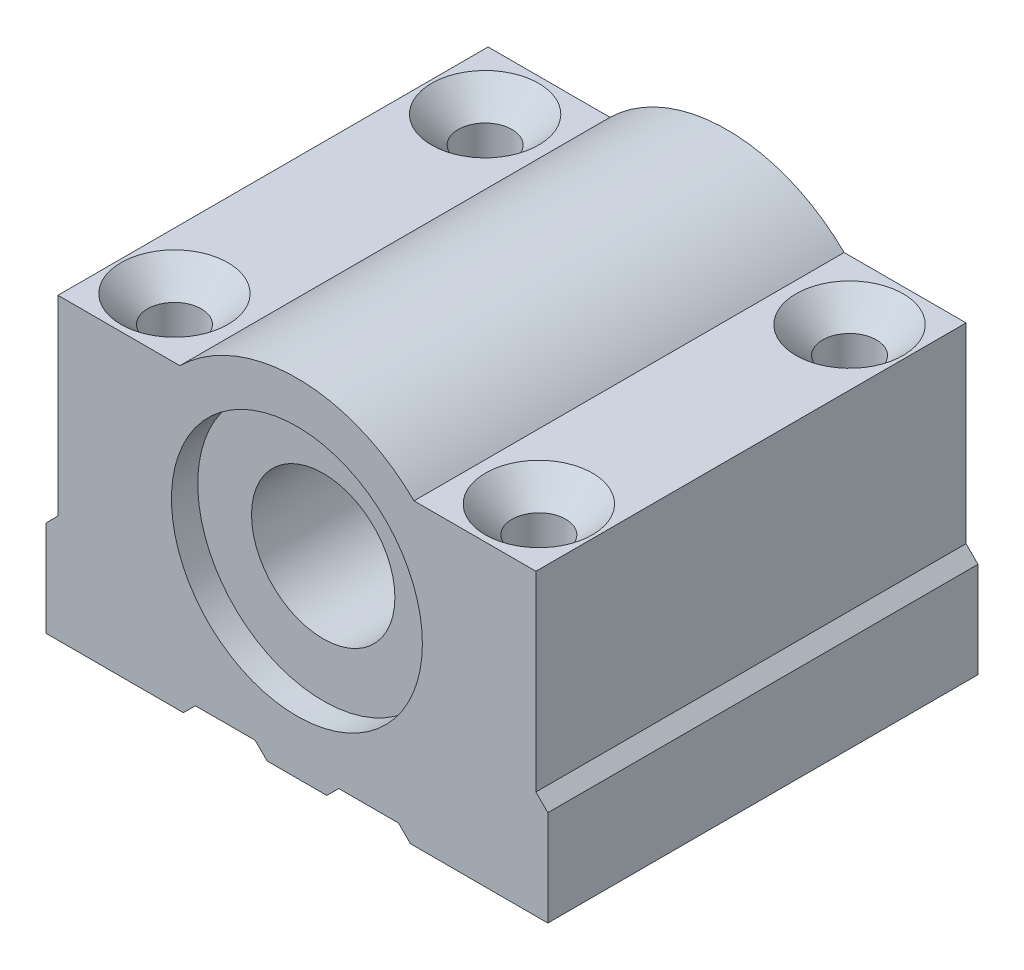
ISO-10303-21;
HEADER;
FILE_DESCRIPTION(('STEP AP214'),'2;1');
FILE_NAME('part.step','',(''),(''),'','','');
FILE_SCHEMA(('AUTOMOTIVE_DESIGN { 1 0 10303 214 1 1 1 1 }'));
ENDSEC;
DATA;
#1=APPLICATION_CONTEXT('core data for automotive mechanical design processes');
#2=APPLICATION_PROTOCOL_DEFINITION('international standard','automotive_design',2000,#1);
#3=PRODUCT_CONTEXT('',#1,'mechanical');
#4=PRODUCT('Part','Part','',(#3));
#5=PRODUCT_RELATED_PRODUCT_CATEGORY('part','',(#4));
#6=PRODUCT_DEFINITION_FORMATION('','',#4);
#7=PRODUCT_DEFINITION_CONTEXT('part definition',#1,'design');
#8=PRODUCT_DEFINITION('design','',#6,#7);
#9=PRODUCT_DEFINITION_SHAPE('','',#8);
#10=(LENGTH_UNIT() NAMED_UNIT(*) SI_UNIT(.MILLI.,.METRE.));
#11=(NAMED_UNIT(*) PLANE_ANGLE_UNIT() SI_UNIT($,.RADIAN.));
#12=(NAMED_UNIT(*) SI_UNIT($,.STERADIAN.) SOLID_ANGLE_UNIT());
#13=UNCERTAINTY_MEASURE_WITH_UNIT(LENGTH_MEASURE(1.E-05),#10,'distance_accuracy_value','');
#14=(GEOMETRIC_REPRESENTATION_CONTEXT(3) GLOBAL_UNCERTAINTY_ASSIGNED_CONTEXT((#13)) GLOBAL_UNIT_ASSIGNED_CONTEXT((#10,
#11,#12)) REPRESENTATION_CONTEXT('',''));
#15=CARTESIAN_POINT('',(0.,0.,0.));
#16=DIRECTION('',(0.,0.,1.));
#17=DIRECTION('',(1.,0.,0.));
#18=AXIS2_PLACEMENT_3D('',#15,#16,#17);
#19=CARTESIAN_POINT('',(0.,0.,36.));
#20=DIRECTION('',(0.,0.,-1.));
#21=DIRECTION('',(-1.,0.,0.));
#22=AXIS2_PLACEMENT_3D('',#19,#20,#21);
#23=CYLINDRICAL_SURFACE('',#22,6.);
#24=CARTESIAN_POINT('',(0.,0.,33.8));
#25=DIRECTION('',(0.,0.,1.));
#26=DIRECTION('',(1.,0.,0.));
#27=AXIS2_PLACEMENT_3D('',#24,#25,#26);
#28=CIRCLE('',#27,6.);
#29=CARTESIAN_POINT('',(6.,0.,33.8));
#30=VERTEX_POINT('',#29);
#31=EDGE_CURVE('E195',#30,#30,#28,.T.);
#32=ORIENTED_EDGE('',*,*,#31,.T.);
#33=EDGE_LOOP('',(#32));
#34=FACE_BOUND('',#33,.T.);
#35=CARTESIAN_POINT('',(0.,0.,2.2));
#36=DIRECTION('',(0.,0.,-1.));
#37=DIRECTION('',(-1.,0.,0.));
#38=AXIS2_PLACEMENT_3D('',#35,#36,#37);
#39=CIRCLE('',#38,6.);
#40=CARTESIAN_POINT('',(-6.,0.,2.2));
#41=VERTEX_POINT('',#40);
#42=EDGE_CURVE('E271',#41,#41,#39,.T.);
#43=ORIENTED_EDGE('',*,*,#42,.T.);
#44=EDGE_LOOP('',(#43));
#45=FACE_BOUND('',#44,.T.);
#46=ADVANCED_FACE('F32',(#34,#45),#23,.F.);
#47=CARTESIAN_POINT('',(0.,0.,36.));
#48=DIRECTION('',(0.,0.,-1.));
#49=DIRECTION('',(-1.,0.,0.));
#50=AXIS2_PLACEMENT_3D('',#47,#48,#49);
#51=PLANE('',#50);
#52=CARTESIAN_POINT('',(0.,0.,36.));
#53=DIRECTION('',(0.,0.,1.));
#54=DIRECTION('',(1.,0.,0.));
#55=AXIS2_PLACEMENT_3D('',#52,#53,#54);
#56=CIRCLE('',#55,10.5);
#57=CARTESIAN_POINT('',(10.5,0.,36.));
#58=VERTEX_POINT('',#57);
#59=EDGE_CURVE('E274',#58,#58,#56,.T.);
#60=ORIENTED_EDGE('',*,*,#59,.F.);
#61=EDGE_LOOP('',(#60));
#62=FACE_BOUND('',#61,.T.);
#63=DIRECTION('',(-1.,0.,0.));
#64=VECTOR('',#63,1.);
#65=CARTESIAN_POINT('',(-9.79795897113271,10.,36.));
#66=LINE('',#65,#64);
#67=CARTESIAN_POINT('',(-9.79795897113271,10.,36.));
#68=VERTEX_POINT('',#67);
#69=CARTESIAN_POINT('',(-20.,10.,36.));
#70=VERTEX_POINT('',#69);
#71=EDGE_CURVE('E226',#68,#70,#66,.T.);
#72=ORIENTED_EDGE('',*,*,#71,.T.);
#73=DIRECTION('',(0.,-1.,0.));
#74=VECTOR('',#73,1.);
#75=CARTESIAN_POINT('',(-20.,10.,36.));
#76=LINE('',#75,#74);
#77=CARTESIAN_POINT('',(-20.,-6.,36.));
#78=VERTEX_POINT('',#77);
#79=EDGE_CURVE('E124',#70,#78,#76,.T.);
#80=ORIENTED_EDGE('',*,*,#79,.T.);
#81=DIRECTION('',(-0.707106781186545,-0.70710678118655,0.));
#82=VECTOR('',#81,1.);
#83=CARTESIAN_POINT('',(-20.,-6.,36.));
#84=LINE('',#83,#82);
#85=CARTESIAN_POINT('',(-21.,-7.,36.));
#86=VERTEX_POINT('',#85);
#87=EDGE_CURVE('E354',#78,#86,#84,.T.);
#88=ORIENTED_EDGE('',*,*,#87,.T.);
#89=DIRECTION('',(0.,-1.,0.));
#90=VECTOR('',#89,1.);
#91=CARTESIAN_POINT('',(-21.,-7.,36.));
#92=LINE('',#91,#90);
#93=CARTESIAN_POINT('',(-21.,-15.,36.));
#94=VERTEX_POINT('',#93);
#95=EDGE_CURVE('E356',#86,#94,#92,.T.);
#96=ORIENTED_EDGE('',*,*,#95,.T.);
#97=DIRECTION('',(1.,0.,0.));
#98=VECTOR('',#97,1.);
#99=CARTESIAN_POINT('',(-21.,-15.,36.));
#100=LINE('',#99,#98);
#101=CARTESIAN_POINT('',(-9.5,-15.,36.));
#102=VERTEX_POINT('',#101);
#103=EDGE_CURVE('E358',#94,#102,#100,.T.);
#104=ORIENTED_EDGE('',*,*,#103,.T.);
#105=DIRECTION('',(0.707106781186547,0.707106781186547,0.));
#106=VECTOR('',#105,1.);
#107=CARTESIAN_POINT('',(-9.5,-15.,36.));
#108=LINE('',#107,#106);
#109=CARTESIAN_POINT('',(-8.5,-14.,36.));
#110=VERTEX_POINT('',#109);
#111=EDGE_CURVE('E360',#102,#110,#108,.T.);
#112=ORIENTED_EDGE('',*,*,#111,.T.);
#113=DIRECTION('',(1.,0.,0.));
#114=VECTOR('',#113,1.);
#115=CARTESIAN_POINT('',(-8.5,-14.,36.));
#116=LINE('',#115,#114);
#117=CARTESIAN_POINT('',(-3.5,-14.,36.));
#118=VERTEX_POINT('',#117);
#119=EDGE_CURVE('E362',#110,#118,#116,.T.);
#120=ORIENTED_EDGE('',*,*,#119,.T.);
#121=DIRECTION('',(0.707106781186547,-0.707106781186547,0.));
#122=VECTOR('',#121,1.);
#123=CARTESIAN_POINT('',(-3.5,-14.,36.));
#124=LINE('',#123,#122);
#125=CARTESIAN_POINT('',(-2.5,-15.,36.));
#126=VERTEX_POINT('',#125);
#127=EDGE_CURVE('E364',#118,#126,#124,.T.);
#128=ORIENTED_EDGE('',*,*,#127,.T.);
#129=DIRECTION('',(1.,0.,0.));
#130=VECTOR('',#129,1.);
#131=CARTESIAN_POINT('',(-2.5,-15.,36.));
#132=LINE('',#131,#130);
#133=CARTESIAN_POINT('',(2.5,-15.,36.));
#134=VERTEX_POINT('',#133);
#135=EDGE_CURVE('E366',#126,#134,#132,.T.);
#136=ORIENTED_EDGE('',*,*,#135,.T.);
#137=DIRECTION('',(0.707106781186548,0.707106781186547,0.));
#138=VECTOR('',#137,1.);
#139=CARTESIAN_POINT('',(2.5,-15.,36.));
#140=LINE('',#139,#138);
#141=CARTESIAN_POINT('',(3.5,-14.,36.));
#142=VERTEX_POINT('',#141);
#143=EDGE_CURVE('E368',#134,#142,#140,.T.);
#144=ORIENTED_EDGE('',*,*,#143,.T.);
#145=DIRECTION('',(1.,0.,0.));
#146=VECTOR('',#145,1.);
#147=CARTESIAN_POINT('',(3.5,-14.,36.));
#148=LINE('',#147,#146);
#149=CARTESIAN_POINT('',(8.5,-14.,36.));
#150=VERTEX_POINT('',#149);
#151=EDGE_CURVE('E370',#142,#150,#148,.T.);
#152=ORIENTED_EDGE('',*,*,#151,.T.);
#153=DIRECTION('',(0.707106781186547,-0.707106781186547,0.));
#154=VECTOR('',#153,1.);
#155=CARTESIAN_POINT('',(8.5,-14.,36.));
#156=LINE('',#155,#154);
#157=CARTESIAN_POINT('',(9.5,-15.,36.));
#158=VERTEX_POINT('',#157);
#159=EDGE_CURVE('E372',#150,#158,#156,.T.);
#160=ORIENTED_EDGE('',*,*,#159,.T.);
#161=DIRECTION('',(1.,0.,0.));
#162=VECTOR('',#161,1.);
#163=CARTESIAN_POINT('',(9.5,-15.,36.));
#164=LINE('',#163,#162);
#165=CARTESIAN_POINT('',(21.,-15.,36.));
#166=VERTEX_POINT('',#165);
#167=EDGE_CURVE('E374',#158,#166,#164,.T.);
#168=ORIENTED_EDGE('',*,*,#167,.T.);
#169=DIRECTION('',(0.,1.,0.));
#170=VECTOR('',#169,1.);
#171=CARTESIAN_POINT('',(21.,-15.,36.));
#172=LINE('',#171,#170);
#173=CARTESIAN_POINT('',(21.,-7.,36.));
#174=VERTEX_POINT('',#173);
#175=EDGE_CURVE('E376',#166,#174,#172,.T.);
#176=ORIENTED_EDGE('',*,*,#175,.T.);
#177=DIRECTION('',(-0.707106781186548,0.707106781186548,0.));
#178=VECTOR('',#177,1.);
#179=CARTESIAN_POINT('',(21.,-7.,36.));
#180=LINE('',#179,#178);
#181=CARTESIAN_POINT('',(20.,-5.99999999999999,36.));
#182=VERTEX_POINT('',#181);
#183=EDGE_CURVE('E173',#174,#182,#180,.T.);
#184=ORIENTED_EDGE('',*,*,#183,.T.);
#185=DIRECTION('',(0.,1.,0.));
#186=VECTOR('',#185,1.);
#187=CARTESIAN_POINT('',(20.,-5.99999999999999,36.));
#188=LINE('',#187,#186);
#189=CARTESIAN_POINT('',(20.,10.,36.));
#190=VERTEX_POINT('',#189);
#191=EDGE_CURVE('E167',#182,#190,#188,.T.);
#192=ORIENTED_EDGE('',*,*,#191,.T.);
#193=DIRECTION('',(-1.,0.,0.));
#194=VECTOR('',#193,1.);
#195=CARTESIAN_POINT('',(20.,10.,36.));
#196=LINE('',#195,#194);
#197=CARTESIAN_POINT('',(9.79795897113272,10.,36.));
#198=VERTEX_POINT('',#197);
#199=EDGE_CURVE('E171',#190,#198,#196,.T.);
#200=ORIENTED_EDGE('',*,*,#199,.T.);
#201=CARTESIAN_POINT('',(0.,0.,36.));
#202=DIRECTION('',(0.,0.,1.));
#203=DIRECTION('',(-1.,0.,0.));
#204=AXIS2_PLACEMENT_3D('',#201,#202,#203);
#205=CIRCLE('',#204,14.);
#206=EDGE_CURVE('E51',#198,#68,#205,.T.);
#207=ORIENTED_EDGE('',*,*,#206,.T.);
#208=EDGE_LOOP('',(#72,#80,#88,#96,#104,#112,#120,#128,#136,#144,#152,#160,#168,#176,#184,#192,
#200,#207));
#209=FACE_BOUND('',#208,.T.);
#210=ADVANCED_FACE('F169',(#62,#209),#51,.F.);
#211=CARTESIAN_POINT('',(0.,0.,0.));
#212=DIRECTION('',(0.,0.,-1.));
#213=DIRECTION('',(-1.,0.,0.));
#214=AXIS2_PLACEMENT_3D('',#211,#212,#213);
#215=PLANE('',#214);
#216=CARTESIAN_POINT('',(0.,0.,0.));
#217=DIRECTION('',(0.,0.,-1.));
#218=DIRECTION('',(-1.,0.,0.));
#219=AXIS2_PLACEMENT_3D('',#216,#217,#218);
#220=CIRCLE('',#219,10.5);
#221=CARTESIAN_POINT('',(-10.5,0.,0.));
#222=VERTEX_POINT('',#221);
#223=EDGE_CURVE('E343',#222,#222,#220,.T.);
#224=ORIENTED_EDGE('',*,*,#223,.F.);
#225=EDGE_LOOP('',(#224));
#226=FACE_BOUND('',#225,.T.);
#227=DIRECTION('',(-1.,0.,0.));
#228=VECTOR('',#227,1.);
#229=CARTESIAN_POINT('',(-9.79795897113271,10.,0.));
#230=LINE('',#229,#228);
#231=CARTESIAN_POINT('',(-9.79795897113271,10.,0.));
#232=VERTEX_POINT('',#231);
#233=CARTESIAN_POINT('',(-20.,10.,0.));
#234=VERTEX_POINT('',#233);
#235=EDGE_CURVE('E191',#232,#234,#230,.T.);
#236=ORIENTED_EDGE('',*,*,#235,.F.);
#237=CARTESIAN_POINT('',(0.,0.,0.));
#238=DIRECTION('',(0.,0.,1.));
#239=DIRECTION('',(-1.,0.,0.));
#240=AXIS2_PLACEMENT_3D('',#237,#238,#239);
#241=CIRCLE('',#240,14.);
#242=CARTESIAN_POINT('',(9.79795897113272,10.,0.));
#243=VERTEX_POINT('',#242);
#244=EDGE_CURVE('E116',#243,#232,#241,.T.);
#245=ORIENTED_EDGE('',*,*,#244,.F.);
#246=DIRECTION('',(-1.,0.,0.));
#247=VECTOR('',#246,1.);
#248=CARTESIAN_POINT('',(20.,10.,0.));
#249=LINE('',#248,#247);
#250=CARTESIAN_POINT('',(20.,10.,0.));
#251=VERTEX_POINT('',#250);
#252=EDGE_CURVE('E110',#251,#243,#249,.T.);
#253=ORIENTED_EDGE('',*,*,#252,.F.);
#254=DIRECTION('',(0.,1.,0.));
#255=VECTOR('',#254,1.);
#256=CARTESIAN_POINT('',(20.,-5.99999999999999,0.));
#257=LINE('',#256,#255);
#258=CARTESIAN_POINT('',(20.,-5.99999999999999,0.));
#259=VERTEX_POINT('',#258);
#260=EDGE_CURVE('E181',#259,#251,#257,.T.);
#261=ORIENTED_EDGE('',*,*,#260,.F.);
#262=DIRECTION('',(-0.707106781186548,0.707106781186548,0.));
#263=VECTOR('',#262,1.);
#264=CARTESIAN_POINT('',(21.,-7.,0.));
#265=LINE('',#264,#263);
#266=CARTESIAN_POINT('',(21.,-7.,0.));
#267=VERTEX_POINT('',#266);
#268=EDGE_CURVE('E221',#267,#259,#265,.T.);
#269=ORIENTED_EDGE('',*,*,#268,.F.);
#270=DIRECTION('',(0.,1.,0.));
#271=VECTOR('',#270,1.);
#272=CARTESIAN_POINT('',(21.,-15.,0.));
#273=LINE('',#272,#271);
#274=CARTESIAN_POINT('',(21.,-15.,0.));
#275=VERTEX_POINT('',#274);
#276=EDGE_CURVE('E219',#275,#267,#273,.T.);
#277=ORIENTED_EDGE('',*,*,#276,.F.);
#278=DIRECTION('',(1.,0.,0.));
#279=VECTOR('',#278,1.);
#280=CARTESIAN_POINT('',(9.5,-15.,0.));
#281=LINE('',#280,#279);
#282=CARTESIAN_POINT('',(9.5,-15.,0.));
#283=VERTEX_POINT('',#282);
#284=EDGE_CURVE('E217',#283,#275,#281,.T.);
#285=ORIENTED_EDGE('',*,*,#284,.F.);
#286=DIRECTION('',(0.707106781186547,-0.707106781186547,0.));
#287=VECTOR('',#286,1.);
#288=CARTESIAN_POINT('',(8.5,-14.,0.));
#289=LINE('',#288,#287);
#290=CARTESIAN_POINT('',(8.5,-14.,0.));
#291=VERTEX_POINT('',#290);
#292=EDGE_CURVE('E215',#291,#283,#289,.T.);
#293=ORIENTED_EDGE('',*,*,#292,.F.);
#294=DIRECTION('',(1.,0.,0.));
#295=VECTOR('',#294,1.);
#296=CARTESIAN_POINT('',(3.5,-14.,0.));
#297=LINE('',#296,#295);
#298=CARTESIAN_POINT('',(3.5,-14.,0.));
#299=VERTEX_POINT('',#298);
#300=EDGE_CURVE('E213',#299,#291,#297,.T.);
#301=ORIENTED_EDGE('',*,*,#300,.F.);
#302=DIRECTION('',(0.707106781186548,0.707106781186547,0.));
#303=VECTOR('',#302,1.);
#304=CARTESIAN_POINT('',(2.5,-15.,0.));
#305=LINE('',#304,#303);
#306=CARTESIAN_POINT('',(2.5,-15.,0.));
#307=VERTEX_POINT('',#306);
#308=EDGE_CURVE('E211',#307,#299,#305,.T.);
#309=ORIENTED_EDGE('',*,*,#308,.F.);
#310=DIRECTION('',(1.,0.,0.));
#311=VECTOR('',#310,1.);
#312=CARTESIAN_POINT('',(-2.5,-15.,0.));
#313=LINE('',#312,#311);
#314=CARTESIAN_POINT('',(-2.5,-15.,0.));
#315=VERTEX_POINT('',#314);
#316=EDGE_CURVE('E209',#315,#307,#313,.T.);
#317=ORIENTED_EDGE('',*,*,#316,.F.);
#318=DIRECTION('',(0.707106781186547,-0.707106781186547,0.));
#319=VECTOR('',#318,1.);
#320=CARTESIAN_POINT('',(-3.5,-14.,0.));
#321=LINE('',#320,#319);
#322=CARTESIAN_POINT('',(-3.5,-14.,0.));
#323=VERTEX_POINT('',#322);
#324=EDGE_CURVE('E207',#323,#315,#321,.T.);
#325=ORIENTED_EDGE('',*,*,#324,.F.);
#326=DIRECTION('',(1.,0.,0.));
#327=VECTOR('',#326,1.);
#328=CARTESIAN_POINT('',(-8.5,-14.,0.));
#329=LINE('',#328,#327);
#330=CARTESIAN_POINT('',(-8.5,-14.,0.));
#331=VERTEX_POINT('',#330);
#332=EDGE_CURVE('E205',#331,#323,#329,.T.);
#333=ORIENTED_EDGE('',*,*,#332,.F.);
#334=DIRECTION('',(0.707106781186547,0.707106781186547,0.));
#335=VECTOR('',#334,1.);
#336=CARTESIAN_POINT('',(-9.5,-15.,0.));
#337=LINE('',#336,#335);
#338=CARTESIAN_POINT('',(-9.5,-15.,0.));
#339=VERTEX_POINT('',#338);
#340=EDGE_CURVE('E203',#339,#331,#337,.T.);
#341=ORIENTED_EDGE('',*,*,#340,.F.);
#342=DIRECTION('',(1.,0.,0.));
#343=VECTOR('',#342,1.);
#344=CARTESIAN_POINT('',(-21.,-15.,0.));
#345=LINE('',#344,#343);
#346=CARTESIAN_POINT('',(-21.,-15.,0.));
#347=VERTEX_POINT('',#346);
#348=EDGE_CURVE('E201',#347,#339,#345,.T.);
#349=ORIENTED_EDGE('',*,*,#348,.F.);
#350=DIRECTION('',(0.,-1.,0.));
#351=VECTOR('',#350,1.);
#352=CARTESIAN_POINT('',(-21.,-7.,0.));
#353=LINE('',#352,#351);
#354=CARTESIAN_POINT('',(-21.,-7.,0.));
#355=VERTEX_POINT('',#354);
#356=EDGE_CURVE('E199',#355,#347,#353,.T.);
#357=ORIENTED_EDGE('',*,*,#356,.F.);
#358=DIRECTION('',(-0.707106781186545,-0.70710678118655,0.));
#359=VECTOR('',#358,1.);
#360=CARTESIAN_POINT('',(-20.,-6.,0.));
#361=LINE('',#360,#359);
#362=CARTESIAN_POINT('',(-20.,-6.,0.));
#363=VERTEX_POINT('',#362);
#364=EDGE_CURVE('E197',#363,#355,#361,.T.);
#365=ORIENTED_EDGE('',*,*,#364,.F.);
#366=DIRECTION('',(0.,-1.,0.));
#367=VECTOR('',#366,1.);
#368=CARTESIAN_POINT('',(-20.,10.,0.));
#369=LINE('',#368,#367);
#370=EDGE_CURVE('E194',#234,#363,#369,.T.);
#371=ORIENTED_EDGE('',*,*,#370,.F.);
#372=EDGE_LOOP('',(#236,#245,#253,#261,#269,#277,#285,#293,#301,#309,#317,#325,#333,#341,#349,
#357,#365,#371));
#373=FACE_BOUND('',#372,.T.);
#374=ADVANCED_FACE('F389',(#226,#373),#215,.T.);
#375=CARTESIAN_POINT('',(-9.79795897113271,10.,36.));
#376=DIRECTION('',(0.,-1.,0.));
#377=DIRECTION('',(0.,0.,-1.));
#378=AXIS2_PLACEMENT_3D('',#375,#376,#377);
#379=PLANE('',#378);
#380=CARTESIAN_POINT('',(-15.25,10.,5.));
#381=DIRECTION('',(0.,1.,0.));
#382=DIRECTION('',(0.,0.,1.));
#383=AXIS2_PLACEMENT_3D('',#380,#381,#382);
#384=CIRCLE('',#383,4.48);
#385=CARTESIAN_POINT('',(-15.25,10.,9.48));
#386=VERTEX_POINT('',#385);
#387=EDGE_CURVE('E526',#386,#386,#384,.T.);
#388=ORIENTED_EDGE('',*,*,#387,.F.);
#389=EDGE_LOOP('',(#388));
#390=FACE_BOUND('',#389,.T.);
#391=CARTESIAN_POINT('',(-15.25,10.,31.));
#392=DIRECTION('',(0.,1.,0.));
#393=DIRECTION('',(0.,0.,1.));
#394=AXIS2_PLACEMENT_3D('',#391,#392,#393);
#395=CIRCLE('',#394,4.48);
#396=CARTESIAN_POINT('',(-15.25,10.,35.48));
#397=VERTEX_POINT('',#396);
#398=EDGE_CURVE('E294',#397,#397,#395,.T.);
#399=ORIENTED_EDGE('',*,*,#398,.F.);
#400=EDGE_LOOP('',(#399));
#401=FACE_BOUND('',#400,.T.);
#402=ORIENTED_EDGE('',*,*,#235,.T.);
#403=DIRECTION('',(0.,0.,-1.));
#404=VECTOR('',#403,1.);
#405=CARTESIAN_POINT('',(-20.,10.,36.));
#406=LINE('',#405,#404);
#407=EDGE_CURVE('E11',#70,#234,#406,.T.);
#408=ORIENTED_EDGE('',*,*,#407,.F.);
#409=ORIENTED_EDGE('',*,*,#71,.F.);
#410=DIRECTION('',(0.,0.,-1.));
#411=VECTOR('',#410,1.);
#412=CARTESIAN_POINT('',(-9.79795897113271,10.,36.));
#413=LINE('',#412,#411);
#414=EDGE_CURVE('E187',#68,#232,#413,.T.);
#415=ORIENTED_EDGE('',*,*,#414,.T.);
#416=EDGE_LOOP('',(#402,#408,#409,#415));
#417=FACE_BOUND('',#416,.T.);
#418=ADVANCED_FACE('F34',(#390,#401,#417),#379,.F.);
#419=CARTESIAN_POINT('',(-20.,10.,36.));
#420=DIRECTION('',(1.,0.,0.));
#421=DIRECTION('',(0.,1.,0.));
#422=AXIS2_PLACEMENT_3D('',#419,#420,#421);
#423=PLANE('',#422);
#424=ORIENTED_EDGE('',*,*,#370,.T.);
#425=DIRECTION('',(0.,0.,-1.));
#426=VECTOR('',#425,1.);
#427=CARTESIAN_POINT('',(-20.,-6.,36.));
#428=LINE('',#427,#426);
#429=EDGE_CURVE('E42',#78,#363,#428,.T.);
#430=ORIENTED_EDGE('',*,*,#429,.F.);
#431=ORIENTED_EDGE('',*,*,#79,.F.);
#432=ORIENTED_EDGE('',*,*,#407,.T.);
#433=EDGE_LOOP('',(#424,#430,#431,#432));
#434=FACE_BOUND('',#433,.T.);
#435=ADVANCED_FACE('F423',(#434),#423,.F.);
#436=CARTESIAN_POINT('',(-20.,-6.,36.));
#437=DIRECTION('',(0.70710678118655,-0.707106781186545,0.));
#438=DIRECTION('',(0.707106781186545,0.70710678118655,0.));
#439=AXIS2_PLACEMENT_3D('',#436,#437,#438);
#440=PLANE('',#439);
#441=ORIENTED_EDGE('',*,*,#364,.T.);
#442=DIRECTION('',(0.,0.,-1.));
#443=VECTOR('',#442,1.);
#444=CARTESIAN_POINT('',(-21.,-7.,36.));
#445=LINE('',#444,#443);
#446=EDGE_CURVE('E263',#86,#355,#445,.T.);
#447=ORIENTED_EDGE('',*,*,#446,.F.);
#448=ORIENTED_EDGE('',*,*,#87,.F.);
#449=ORIENTED_EDGE('',*,*,#429,.T.);
#450=EDGE_LOOP('',(#441,#447,#448,#449));
#451=FACE_BOUND('',#450,.T.);
#452=ADVANCED_FACE('F572',(#451),#440,.F.);
#453=CARTESIAN_POINT('',(-21.,-7.,36.));
#454=DIRECTION('',(1.,0.,0.));
#455=DIRECTION('',(0.,0.,-1.));
#456=AXIS2_PLACEMENT_3D('',#453,#454,#455);
#457=PLANE('',#456);
#458=ORIENTED_EDGE('',*,*,#356,.T.);
#459=DIRECTION('',(0.,0.,-1.));
#460=VECTOR('',#459,1.);
#461=CARTESIAN_POINT('',(-21.,-15.,36.));
#462=LINE('',#461,#460);
#463=EDGE_CURVE('E260',#94,#347,#462,.T.);
#464=ORIENTED_EDGE('',*,*,#463,.F.);
#465=ORIENTED_EDGE('',*,*,#95,.F.);
#466=ORIENTED_EDGE('',*,*,#446,.T.);
#467=EDGE_LOOP('',(#458,#464,#465,#466));
#468=FACE_BOUND('',#467,.T.);
#469=ADVANCED_FACE('F542',(#468),#457,.F.);
#470=CARTESIAN_POINT('',(-21.,-15.,36.));
#471=DIRECTION('',(0.,1.,0.));
#472=DIRECTION('',(0.,0.,1.));
#473=AXIS2_PLACEMENT_3D('',#470,#471,#472);
#474=PLANE('',#473);
#475=CARTESIAN_POINT('',(-15.25,-15.,31.));
#476=DIRECTION('',(0.,-1.,0.));
#477=DIRECTION('',(0.,0.,-1.));
#478=AXIS2_PLACEMENT_3D('',#475,#476,#477);
#479=CIRCLE('',#478,4.5);
#480=CARTESIAN_POINT('',(-15.25,-15.,26.5));
#481=VERTEX_POINT('',#480);
#482=EDGE_CURVE('E279',#481,#481,#479,.T.);
#483=ORIENTED_EDGE('',*,*,#482,.F.);
#484=EDGE_LOOP('',(#483));
#485=FACE_BOUND('',#484,.T.);
#486=CARTESIAN_POINT('',(-15.25,-15.,5.));
#487=DIRECTION('',(0.,-1.,0.));
#488=DIRECTION('',(0.,0.,-1.));
#489=AXIS2_PLACEMENT_3D('',#486,#487,#488);
#490=CIRCLE('',#489,4.5);
#491=CARTESIAN_POINT('',(-15.25,-15.,0.499999999999997));
#492=VERTEX_POINT('',#491);
#493=EDGE_CURVE('E316',#492,#492,#490,.T.);
#494=ORIENTED_EDGE('',*,*,#493,.F.);
#495=EDGE_LOOP('',(#494));
#496=FACE_BOUND('',#495,.T.);
#497=ORIENTED_EDGE('',*,*,#348,.T.);
#498=DIRECTION('',(0.,0.,-1.));
#499=VECTOR('',#498,1.);
#500=CARTESIAN_POINT('',(-9.5,-15.,36.));
#501=LINE('',#500,#499);
#502=EDGE_CURVE('E257',#102,#339,#501,.T.);
#503=ORIENTED_EDGE('',*,*,#502,.F.);
#504=ORIENTED_EDGE('',*,*,#103,.F.);
#505=ORIENTED_EDGE('',*,*,#463,.T.);
#506=EDGE_LOOP('',(#497,#503,#504,#505));
#507=FACE_BOUND('',#506,.T.);
#508=ADVANCED_FACE('F538',(#485,#496,#507),#474,.F.);
#509=CARTESIAN_POINT('',(-9.5,-15.,36.));
#510=DIRECTION('',(-0.707106781186547,0.707106781186547,0.));
#511=DIRECTION('',(-0.707106781186548,-0.707106781186548,0.));
#512=AXIS2_PLACEMENT_3D('',#509,#510,#511);
#513=PLANE('',#512);
#514=ORIENTED_EDGE('',*,*,#340,.T.);
#515=DIRECTION('',(0.,0.,-1.));
#516=VECTOR('',#515,1.);
#517=CARTESIAN_POINT('',(-8.5,-14.,36.));
#518=LINE('',#517,#516);
#519=EDGE_CURVE('E254',#110,#331,#518,.T.);
#520=ORIENTED_EDGE('',*,*,#519,.F.);
#521=ORIENTED_EDGE('',*,*,#111,.F.);
#522=ORIENTED_EDGE('',*,*,#502,.T.);
#523=EDGE_LOOP('',(#514,#520,#521,#522));
#524=FACE_BOUND('',#523,.T.);
#525=ADVANCED_FACE('F541',(#524),#513,.F.);
#526=CARTESIAN_POINT('',(-8.5,-14.,36.));
#527=DIRECTION('',(0.,1.,0.));
#528=DIRECTION('',(0.,0.,1.));
#529=AXIS2_PLACEMENT_3D('',#526,#527,#528);
#530=PLANE('',#529);
#531=ORIENTED_EDGE('',*,*,#332,.T.);
#532=DIRECTION('',(0.,0.,-1.));
#533=VECTOR('',#532,1.);
#534=CARTESIAN_POINT('',(-3.5,-14.,36.));
#535=LINE('',#534,#533);
#536=EDGE_CURVE('E251',#118,#323,#535,.T.);
#537=ORIENTED_EDGE('',*,*,#536,.F.);
#538=ORIENTED_EDGE('',*,*,#119,.F.);
#539=ORIENTED_EDGE('',*,*,#519,.T.);
#540=EDGE_LOOP('',(#531,#537,#538,#539));
#541=FACE_BOUND('',#540,.T.);
#542=ADVANCED_FACE('F559',(#541),#530,.F.);
#543=CARTESIAN_POINT('',(-3.5,-14.,36.));
#544=DIRECTION('',(0.707106781186547,0.707106781186547,0.));
#545=DIRECTION('',(-0.707106781186548,0.707106781186548,0.));
#546=AXIS2_PLACEMENT_3D('',#543,#544,#545);
#547=PLANE('',#546);
#548=ORIENTED_EDGE('',*,*,#324,.T.);
#549=DIRECTION('',(0.,0.,-1.));
#550=VECTOR('',#549,1.);
#551=CARTESIAN_POINT('',(-2.5,-15.,36.));
#552=LINE('',#551,#550);
#553=EDGE_CURVE('E248',#126,#315,#552,.T.);
#554=ORIENTED_EDGE('',*,*,#553,.F.);
#555=ORIENTED_EDGE('',*,*,#127,.F.);
#556=ORIENTED_EDGE('',*,*,#536,.T.);
#557=EDGE_LOOP('',(#548,#554,#555,#556));
#558=FACE_BOUND('',#557,.T.);
#559=ADVANCED_FACE('F563',(#558),#547,.F.);
#560=CARTESIAN_POINT('',(-2.5,-15.,36.));
#561=DIRECTION('',(0.,1.,0.));
#562=DIRECTION('',(0.,0.,1.));
#563=AXIS2_PLACEMENT_3D('',#560,#561,#562);
#564=PLANE('',#563);
#565=ORIENTED_EDGE('',*,*,#316,.T.);
#566=DIRECTION('',(0.,0.,-1.));
#567=VECTOR('',#566,1.);
#568=CARTESIAN_POINT('',(2.5,-15.,36.));
#569=LINE('',#568,#567);
#570=EDGE_CURVE('E245',#134,#307,#569,.T.);
#571=ORIENTED_EDGE('',*,*,#570,.F.);
#572=ORIENTED_EDGE('',*,*,#135,.F.);
#573=ORIENTED_EDGE('',*,*,#553,.T.);
#574=EDGE_LOOP('',(#565,#571,#572,#573));
#575=FACE_BOUND('',#574,.T.);
#576=ADVANCED_FACE('F587',(#575),#564,.F.);
#577=CARTESIAN_POINT('',(2.5,-15.,36.));
#578=DIRECTION('',(-0.707106781186547,0.707106781186548,0.));
#579=DIRECTION('',(-0.707106781186548,-0.707106781186547,0.));
#580=AXIS2_PLACEMENT_3D('',#577,#578,#579);
#581=PLANE('',#580);
#582=ORIENTED_EDGE('',*,*,#308,.T.);
#583=DIRECTION('',(0.,0.,-1.));
#584=VECTOR('',#583,1.);
#585=CARTESIAN_POINT('',(3.5,-14.,36.));
#586=LINE('',#585,#584);
#587=EDGE_CURVE('E242',#142,#299,#586,.T.);
#588=ORIENTED_EDGE('',*,*,#587,.F.);
#589=ORIENTED_EDGE('',*,*,#143,.F.);
#590=ORIENTED_EDGE('',*,*,#570,.T.);
#591=EDGE_LOOP('',(#582,#588,#589,#590));
#592=FACE_BOUND('',#591,.T.);
#593=ADVANCED_FACE('F590',(#592),#581,.F.);
#594=CARTESIAN_POINT('',(3.5,-14.,36.));
#595=DIRECTION('',(0.,1.,0.));
#596=DIRECTION('',(0.,0.,1.));
#597=AXIS2_PLACEMENT_3D('',#594,#595,#596);
#598=PLANE('',#597);
#599=ORIENTED_EDGE('',*,*,#300,.T.);
#600=DIRECTION('',(0.,0.,-1.));
#601=VECTOR('',#600,1.);
#602=CARTESIAN_POINT('',(8.5,-14.,36.));
#603=LINE('',#602,#601);
#604=EDGE_CURVE('E239',#150,#291,#603,.T.);
#605=ORIENTED_EDGE('',*,*,#604,.F.);
#606=ORIENTED_EDGE('',*,*,#151,.F.);
#607=ORIENTED_EDGE('',*,*,#587,.T.);
#608=EDGE_LOOP('',(#599,#605,#606,#607));
#609=FACE_BOUND('',#608,.T.);
#610=ADVANCED_FACE('F594',(#609),#598,.F.);
#611=CARTESIAN_POINT('',(8.5,-14.,36.));
#612=DIRECTION('',(0.707106781186547,0.707106781186547,0.));
#613=DIRECTION('',(-0.707106781186548,0.707106781186548,0.));
#614=AXIS2_PLACEMENT_3D('',#611,#612,#613);
#615=PLANE('',#614);
#616=ORIENTED_EDGE('',*,*,#292,.T.);
#617=DIRECTION('',(0.,0.,-1.));
#618=VECTOR('',#617,1.);
#619=CARTESIAN_POINT('',(9.5,-15.,36.));
#620=LINE('',#619,#618);
#621=EDGE_CURVE('E236',#158,#283,#620,.T.);
#622=ORIENTED_EDGE('',*,*,#621,.F.);
#623=ORIENTED_EDGE('',*,*,#159,.F.);
#624=ORIENTED_EDGE('',*,*,#604,.T.);
#625=EDGE_LOOP('',(#616,#622,#623,#624));
#626=FACE_BOUND('',#625,.T.);
#627=ADVANCED_FACE('F598',(#626),#615,.F.);
#628=CARTESIAN_POINT('',(9.5,-15.,36.));
#629=DIRECTION('',(0.,1.,0.));
#630=DIRECTION('',(0.,0.,1.));
#631=AXIS2_PLACEMENT_3D('',#628,#629,#630);
#632=PLANE('',#631);
#633=CARTESIAN_POINT('',(15.25,-15.,5.));
#634=DIRECTION('',(0.,-1.,0.));
#635=DIRECTION('',(0.,0.,-1.));
#636=AXIS2_PLACEMENT_3D('',#633,#634,#635);
#637=CIRCLE('',#636,4.5);
#638=CARTESIAN_POINT('',(15.25,-15.,0.500000000000001));
#639=VERTEX_POINT('',#638);
#640=EDGE_CURVE('E325',#639,#639,#637,.T.);
#641=ORIENTED_EDGE('',*,*,#640,.F.);
#642=EDGE_LOOP('',(#641));
#643=FACE_BOUND('',#642,.T.);
#644=CARTESIAN_POINT('',(15.25,-15.,31.));
#645=DIRECTION('',(0.,-1.,0.));
#646=DIRECTION('',(0.,0.,-1.));
#647=AXIS2_PLACEMENT_3D('',#644,#645,#646);
#648=CIRCLE('',#647,4.5);
#649=CARTESIAN_POINT('',(15.25,-15.,26.5));
#650=VERTEX_POINT('',#649);
#651=EDGE_CURVE('E334',#650,#650,#648,.T.);
#652=ORIENTED_EDGE('',*,*,#651,.F.);
#653=EDGE_LOOP('',(#652));
#654=FACE_BOUND('',#653,.T.);
#655=ORIENTED_EDGE('',*,*,#284,.T.);
#656=DIRECTION('',(0.,0.,-1.));
#657=VECTOR('',#656,1.);
#658=CARTESIAN_POINT('',(21.,-15.,36.));
#659=LINE('',#658,#657);
#660=EDGE_CURVE('E233',#166,#275,#659,.T.);
#661=ORIENTED_EDGE('',*,*,#660,.F.);
#662=ORIENTED_EDGE('',*,*,#167,.F.);
#663=ORIENTED_EDGE('',*,*,#621,.T.);
#664=EDGE_LOOP('',(#655,#661,#662,#663));
#665=FACE_BOUND('',#664,.T.);
#666=ADVANCED_FACE('F602',(#643,#654,#665),#632,.F.);
#667=CARTESIAN_POINT('',(21.,-15.,36.));
#668=DIRECTION('',(-1.,0.,0.));
#669=DIRECTION('',(0.,0.,1.));
#670=AXIS2_PLACEMENT_3D('',#667,#668,#669);
#671=PLANE('',#670);
#672=ORIENTED_EDGE('',*,*,#276,.T.);
#673=DIRECTION('',(0.,0.,-1.));
#674=VECTOR('',#673,1.);
#675=CARTESIAN_POINT('',(21.,-7.,36.));
#676=LINE('',#675,#674);
#677=EDGE_CURVE('E230',#174,#267,#676,.T.);
#678=ORIENTED_EDGE('',*,*,#677,.F.);
#679=ORIENTED_EDGE('',*,*,#175,.F.);
#680=ORIENTED_EDGE('',*,*,#660,.T.);
#681=EDGE_LOOP('',(#672,#678,#679,#680));
#682=FACE_BOUND('',#681,.T.);
#683=ADVANCED_FACE('F382',(#682),#671,.F.);
#684=CARTESIAN_POINT('',(21.,-7.,36.));
#685=DIRECTION('',(-0.707106781186547,-0.707106781186547,0.));
#686=DIRECTION('',(0.707106781186548,-0.707106781186548,0.));
#687=AXIS2_PLACEMENT_3D('',#684,#685,#686);
#688=PLANE('',#687);
#689=ORIENTED_EDGE('',*,*,#268,.T.);
#690=DIRECTION('',(0.,0.,-1.));
#691=VECTOR('',#690,1.);
#692=CARTESIAN_POINT('',(20.,-5.99999999999999,36.));
#693=LINE('',#692,#691);
#694=EDGE_CURVE('E182',#182,#259,#693,.T.);
#695=ORIENTED_EDGE('',*,*,#694,.F.);
#696=ORIENTED_EDGE('',*,*,#183,.F.);
#697=ORIENTED_EDGE('',*,*,#677,.T.);
#698=EDGE_LOOP('',(#689,#695,#696,#697));
#699=FACE_BOUND('',#698,.T.);
#700=ADVANCED_FACE('F386',(#699),#688,.F.);
#701=CARTESIAN_POINT('',(20.,-5.99999999999999,36.));
#702=DIRECTION('',(-1.,0.,0.));
#703=DIRECTION('',(0.,-1.,0.));
#704=AXIS2_PLACEMENT_3D('',#701,#702,#703);
#705=PLANE('',#704);
#706=ORIENTED_EDGE('',*,*,#260,.T.);
#707=DIRECTION('',(0.,0.,-1.));
#708=VECTOR('',#707,1.);
#709=CARTESIAN_POINT('',(20.,10.,36.));
#710=LINE('',#709,#708);
#711=EDGE_CURVE('E178',#190,#251,#710,.T.);
#712=ORIENTED_EDGE('',*,*,#711,.F.);
#713=ORIENTED_EDGE('',*,*,#191,.F.);
#714=ORIENTED_EDGE('',*,*,#694,.T.);
#715=EDGE_LOOP('',(#706,#712,#713,#714));
#716=FACE_BOUND('',#715,.T.);
#717=ADVANCED_FACE('F179',(#716),#705,.F.);
#718=CARTESIAN_POINT('',(20.,10.,36.));
#719=DIRECTION('',(0.,-1.,0.));
#720=DIRECTION('',(0.,0.,-1.));
#721=AXIS2_PLACEMENT_3D('',#718,#719,#720);
#722=PLANE('',#721);
#723=CARTESIAN_POINT('',(15.25,10.,31.));
#724=DIRECTION('',(0.,1.,0.));
#725=DIRECTION('',(0.,0.,1.));
#726=AXIS2_PLACEMENT_3D('',#723,#724,#725);
#727=CIRCLE('',#726,4.48);
#728=CARTESIAN_POINT('',(15.25,10.,35.48));
#729=VERTEX_POINT('',#728);
#730=EDGE_CURVE('E287',#729,#729,#727,.T.);
#731=ORIENTED_EDGE('',*,*,#730,.F.);
#732=EDGE_LOOP('',(#731));
#733=FACE_BOUND('',#732,.T.);
#734=CARTESIAN_POINT('',(15.25,10.,5.));
#735=DIRECTION('',(0.,1.,0.));
#736=DIRECTION('',(0.,0.,1.));
#737=AXIS2_PLACEMENT_3D('',#734,#735,#736);
#738=CIRCLE('',#737,4.48);
#739=CARTESIAN_POINT('',(15.25,10.,9.48));
#740=VERTEX_POINT('',#739);
#741=EDGE_CURVE('E283',#740,#740,#738,.T.);
#742=ORIENTED_EDGE('',*,*,#741,.F.);
#743=EDGE_LOOP('',(#742));
#744=FACE_BOUND('',#743,.T.);
#745=ORIENTED_EDGE('',*,*,#252,.T.);
#746=DIRECTION('',(0.,0.,-1.));
#747=VECTOR('',#746,1.);
#748=CARTESIAN_POINT('',(9.79795897113272,10.,36.));
#749=LINE('',#748,#747);
#750=EDGE_CURVE('E183',#198,#243,#749,.T.);
#751=ORIENTED_EDGE('',*,*,#750,.F.);
#752=ORIENTED_EDGE('',*,*,#199,.F.);
#753=ORIENTED_EDGE('',*,*,#711,.T.);
#754=EDGE_LOOP('',(#745,#751,#752,#753));
#755=FACE_BOUND('',#754,.T.);
#756=ADVANCED_FACE('F185',(#733,#744,#755),#722,.F.);
#757=CARTESIAN_POINT('',(0.,0.,36.));
#758=DIRECTION('',(0.,0.,-1.));
#759=DIRECTION('',(-1.,0.,0.));
#760=AXIS2_PLACEMENT_3D('',#757,#758,#759);
#761=CYLINDRICAL_SURFACE('',#760,14.);
#762=ORIENTED_EDGE('',*,*,#244,.T.);
#763=ORIENTED_EDGE('',*,*,#414,.F.);
#764=ORIENTED_EDGE('',*,*,#206,.F.);
#765=ORIENTED_EDGE('',*,*,#750,.T.);
#766=EDGE_LOOP('',(#762,#763,#764,#765));
#767=FACE_BOUND('',#766,.T.);
#768=ADVANCED_FACE('F394',(#767),#761,.T.);
#769=CARTESIAN_POINT('',(0.,0.,33.8));
#770=DIRECTION('',(0.,0.,1.));
#771=DIRECTION('',(1.,0.,0.));
#772=AXIS2_PLACEMENT_3D('',#769,#770,#771);
#773=CYLINDRICAL_SURFACE('',#772,10.5);
#774=CARTESIAN_POINT('',(0.,0.,33.8));
#775=DIRECTION('',(0.,0.,1.));
#776=DIRECTION('',(1.,0.,0.));
#777=AXIS2_PLACEMENT_3D('',#774,#775,#776);
#778=CIRCLE('',#777,10.5);
#779=CARTESIAN_POINT('',(10.5,0.,33.8));
#780=VERTEX_POINT('',#779);
#781=EDGE_CURVE('E270',#780,#780,#778,.T.);
#782=ORIENTED_EDGE('',*,*,#781,.F.);
#783=EDGE_LOOP('',(#782));
#784=FACE_BOUND('',#783,.T.);
#785=ORIENTED_EDGE('',*,*,#59,.T.);
#786=EDGE_LOOP('',(#785));
#787=FACE_BOUND('',#786,.T.);
#788=ADVANCED_FACE('F396',(#784,#787),#773,.F.);
#789=CARTESIAN_POINT('',(0.,0.,33.8));
#790=DIRECTION('',(0.,0.,1.));
#791=DIRECTION('',(1.,0.,0.));
#792=AXIS2_PLACEMENT_3D('',#789,#790,#791);
#793=PLANE('',#792);
#794=ORIENTED_EDGE('',*,*,#31,.F.);
#795=EDGE_LOOP('',(#794));
#796=FACE_BOUND('',#795,.T.);
#797=ORIENTED_EDGE('',*,*,#781,.T.);
#798=EDGE_LOOP('',(#797));
#799=FACE_BOUND('',#798,.T.);
#800=ADVANCED_FACE('F402',(#796,#799),#793,.T.);
#801=CARTESIAN_POINT('',(0.,0.,2.2));
#802=DIRECTION('',(0.,0.,-1.));
#803=DIRECTION('',(-1.,0.,0.));
#804=AXIS2_PLACEMENT_3D('',#801,#802,#803);
#805=CYLINDRICAL_SURFACE('',#804,10.5);
#806=CARTESIAN_POINT('',(0.,0.,2.2));
#807=DIRECTION('',(0.,0.,-1.));
#808=DIRECTION('',(-1.,0.,0.));
#809=AXIS2_PLACEMENT_3D('',#806,#807,#808);
#810=CIRCLE('',#809,10.5);
#811=CARTESIAN_POINT('',(-10.5,0.,2.2));
#812=VERTEX_POINT('',#811);
#813=EDGE_CURVE('E275',#812,#812,#810,.T.);
#814=ORIENTED_EDGE('',*,*,#813,.F.);
#815=EDGE_LOOP('',(#814));
#816=FACE_BOUND('',#815,.T.);
#817=ORIENTED_EDGE('',*,*,#223,.T.);
#818=EDGE_LOOP('',(#817));
#819=FACE_BOUND('',#818,.T.);
#820=ADVANCED_FACE('F427',(#816,#819),#805,.F.);
#821=CARTESIAN_POINT('',(0.,0.,2.2));
#822=DIRECTION('',(0.,0.,-1.));
#823=DIRECTION('',(-1.,0.,0.));
#824=AXIS2_PLACEMENT_3D('',#821,#822,#823);
#825=PLANE('',#824);
#826=ORIENTED_EDGE('',*,*,#42,.F.);
#827=EDGE_LOOP('',(#826));
#828=FACE_BOUND('',#827,.T.);
#829=ORIENTED_EDGE('',*,*,#813,.T.);
#830=EDGE_LOOP('',(#829));
#831=FACE_BOUND('',#830,.T.);
#832=ADVANCED_FACE('F429',(#828,#831),#825,.T.);
#833=CARTESIAN_POINT('',(15.25,-3.,31.));
#834=DIRECTION('',(0.,-1.,0.));
#835=DIRECTION('',(0.,0.,-1.));
#836=AXIS2_PLACEMENT_3D('',#833,#834,#835);
#837=CONICAL_SURFACE('',#836,2.75,1.02974425867665);
#838=CARTESIAN_POINT('',(15.25,-2.69956969048622,31.));
#839=DIRECTION('',(0.,-1.,0.));
#840=DIRECTION('',(0.,0.,-1.));
#841=AXIS2_PLACEMENT_3D('',#838,#839,#840);
#842=CIRCLE('',#841,2.25);
#843=CARTESIAN_POINT('',(15.25,-2.69956969048622,28.75));
#844=VERTEX_POINT('',#843);
#845=EDGE_CURVE('E281',#844,#844,#842,.F.);
#846=ORIENTED_EDGE('',*,*,#845,.T.);
#847=EDGE_LOOP('',(#846));
#848=FACE_BOUND('',#847,.T.);
#849=CARTESIAN_POINT('',(15.25,-3.,31.));
#850=DIRECTION('',(0.,-1.,0.));
#851=DIRECTION('',(0.,0.,-1.));
#852=AXIS2_PLACEMENT_3D('',#849,#850,#851);
#853=CIRCLE('',#852,2.75);
#854=CARTESIAN_POINT('',(15.25,-3.,28.25));
#855=VERTEX_POINT('',#854);
#856=EDGE_CURVE('E340',#855,#855,#853,.T.);
#857=ORIENTED_EDGE('',*,*,#856,.T.);
#858=EDGE_LOOP('',(#857));
#859=FACE_BOUND('',#858,.T.);
#860=ADVANCED_FACE('F436',(#848,#859),#837,.F.);
#861=CARTESIAN_POINT('',(15.25,-15.,31.));
#862=DIRECTION('',(0.,-1.,0.));
#863=DIRECTION('',(0.,0.,-1.));
#864=AXIS2_PLACEMENT_3D('',#861,#862,#863);
#865=CYLINDRICAL_SURFACE('',#864,2.75);
#866=ORIENTED_EDGE('',*,*,#856,.F.);
#867=EDGE_LOOP('',(#866));
#868=FACE_BOUND('',#867,.T.);
#869=CARTESIAN_POINT('',(15.25,-13.25,31.));
#870=DIRECTION('',(0.,-1.,0.));
#871=DIRECTION('',(0.,0.,-1.));
#872=AXIS2_PLACEMENT_3D('',#869,#870,#871);
#873=CIRCLE('',#872,2.75);
#874=CARTESIAN_POINT('',(15.25,-13.25,28.25));
#875=VERTEX_POINT('',#874);
#876=EDGE_CURVE('E337',#875,#875,#873,.T.);
#877=ORIENTED_EDGE('',*,*,#876,.T.);
#878=EDGE_LOOP('',(#877));
#879=FACE_BOUND('',#878,.T.);
#880=ADVANCED_FACE('F444',(#868,#879),#865,.F.);
#881=CARTESIAN_POINT('',(15.25,-15.,31.));
#882=DIRECTION('',(0.,-1.,0.));
#883=DIRECTION('',(0.,0.,-1.));
#884=AXIS2_PLACEMENT_3D('',#881,#882,#883);
#885=CONICAL_SURFACE('',#884,4.5,0.785398163397448);
#886=ORIENTED_EDGE('',*,*,#876,.F.);
#887=EDGE_LOOP('',(#886));
#888=FACE_BOUND('',#887,.T.);
#889=ORIENTED_EDGE('',*,*,#651,.T.);
#890=EDGE_LOOP('',(#889));
#891=FACE_BOUND('',#890,.T.);
#892=ADVANCED_FACE('F448',(#888,#891),#885,.F.);
#893=CARTESIAN_POINT('',(15.25,-3.,5.));
#894=DIRECTION('',(0.,-1.,0.));
#895=DIRECTION('',(0.,0.,-1.));
#896=AXIS2_PLACEMENT_3D('',#893,#894,#895);
#897=CONICAL_SURFACE('',#896,2.75,1.02974425867665);
#898=CARTESIAN_POINT('',(15.25,-2.69956969048622,5.));
#899=DIRECTION('',(0.,-1.,0.));
#900=DIRECTION('',(0.,0.,-1.));
#901=AXIS2_PLACEMENT_3D('',#898,#899,#900);
#902=CIRCLE('',#901,2.25);
#903=CARTESIAN_POINT('',(15.25,-2.69956969048622,2.75));
#904=VERTEX_POINT('',#903);
#905=EDGE_CURVE('E276',#904,#904,#902,.F.);
#906=ORIENTED_EDGE('',*,*,#905,.T.);
#907=EDGE_LOOP('',(#906));
#908=FACE_BOUND('',#907,.T.);
#909=CARTESIAN_POINT('',(15.25,-3.,5.));
#910=DIRECTION('',(0.,-1.,0.));
#911=DIRECTION('',(0.,0.,-1.));
#912=AXIS2_PLACEMENT_3D('',#909,#910,#911);
#913=CIRCLE('',#912,2.75);
#914=CARTESIAN_POINT('',(15.25,-3.,2.25));
#915=VERTEX_POINT('',#914);
#916=EDGE_CURVE('E331',#915,#915,#913,.T.);
#917=ORIENTED_EDGE('',*,*,#916,.T.);
#918=EDGE_LOOP('',(#917));
#919=FACE_BOUND('',#918,.T.);
#920=ADVANCED_FACE('F452',(#908,#919),#897,.F.);
#921=CARTESIAN_POINT('',(15.25,-15.,5.));
#922=DIRECTION('',(0.,-1.,0.));
#923=DIRECTION('',(0.,0.,-1.));
#924=AXIS2_PLACEMENT_3D('',#921,#922,#923);
#925=CYLINDRICAL_SURFACE('',#924,2.75);
#926=ORIENTED_EDGE('',*,*,#916,.F.);
#927=EDGE_LOOP('',(#926));
#928=FACE_BOUND('',#927,.T.);
#929=CARTESIAN_POINT('',(15.25,-13.25,5.));
#930=DIRECTION('',(0.,-1.,0.));
#931=DIRECTION('',(0.,0.,-1.));
#932=AXIS2_PLACEMENT_3D('',#929,#930,#931);
#933=CIRCLE('',#932,2.75);
#934=CARTESIAN_POINT('',(15.25,-13.25,2.25));
#935=VERTEX_POINT('',#934);
#936=EDGE_CURVE('E328',#935,#935,#933,.T.);
#937=ORIENTED_EDGE('',*,*,#936,.T.);
#938=EDGE_LOOP('',(#937));
#939=FACE_BOUND('',#938,.T.);
#940=ADVANCED_FACE('F456',(#928,#939),#925,.F.);
#941=CARTESIAN_POINT('',(15.25,-15.,5.));
#942=DIRECTION('',(0.,-1.,0.));
#943=DIRECTION('',(0.,0.,-1.));
#944=AXIS2_PLACEMENT_3D('',#941,#942,#943);
#945=CONICAL_SURFACE('',#944,4.5,0.785398163397448);
#946=ORIENTED_EDGE('',*,*,#936,.F.);
#947=EDGE_LOOP('',(#946));
#948=FACE_BOUND('',#947,.T.);
#949=ORIENTED_EDGE('',*,*,#640,.T.);
#950=EDGE_LOOP('',(#949));
#951=FACE_BOUND('',#950,.T.);
#952=ADVANCED_FACE('F460',(#948,#951),#945,.F.);
#953=CARTESIAN_POINT('',(-15.25,-3.,5.));
#954=DIRECTION('',(0.,-1.,0.));
#955=DIRECTION('',(0.,0.,-1.));
#956=AXIS2_PLACEMENT_3D('',#953,#954,#955);
#957=CONICAL_SURFACE('',#956,2.75,1.02974425867665);
#958=CARTESIAN_POINT('',(-15.25,-2.69956969048622,5.));
#959=DIRECTION('',(0.,-1.,0.));
#960=DIRECTION('',(0.,0.,-1.));
#961=AXIS2_PLACEMENT_3D('',#958,#959,#960);
#962=CIRCLE('',#961,2.25);
#963=CARTESIAN_POINT('',(-15.25,-2.69956969048622,2.75));
#964=VERTEX_POINT('',#963);
#965=EDGE_CURVE('E36',#964,#964,#962,.F.);
#966=ORIENTED_EDGE('',*,*,#965,.T.);
#967=EDGE_LOOP('',(#966));
#968=FACE_BOUND('',#967,.T.);
#969=CARTESIAN_POINT('',(-15.25,-3.,5.));
#970=DIRECTION('',(0.,-1.,0.));
#971=DIRECTION('',(0.,0.,-1.));
#972=AXIS2_PLACEMENT_3D('',#969,#970,#971);
#973=CIRCLE('',#972,2.75);
#974=CARTESIAN_POINT('',(-15.25,-3.,2.25));
#975=VERTEX_POINT('',#974);
#976=EDGE_CURVE('E322',#975,#975,#973,.T.);
#977=ORIENTED_EDGE('',*,*,#976,.T.);
#978=EDGE_LOOP('',(#977));
#979=FACE_BOUND('',#978,.T.);
#980=ADVANCED_FACE('F464',(#968,#979),#957,.F.);
#981=CARTESIAN_POINT('',(-15.25,-15.,5.));
#982=DIRECTION('',(0.,-1.,0.));
#983=DIRECTION('',(0.,0.,-1.));
#984=AXIS2_PLACEMENT_3D('',#981,#982,#983);
#985=CYLINDRICAL_SURFACE('',#984,2.75);
#986=ORIENTED_EDGE('',*,*,#976,.F.);
#987=EDGE_LOOP('',(#986));
#988=FACE_BOUND('',#987,.T.);
#989=CARTESIAN_POINT('',(-15.25,-13.25,5.));
#990=DIRECTION('',(0.,-1.,0.));
#991=DIRECTION('',(0.,0.,-1.));
#992=AXIS2_PLACEMENT_3D('',#989,#990,#991);
#993=CIRCLE('',#992,2.75);
#994=CARTESIAN_POINT('',(-15.25,-13.25,2.25));
#995=VERTEX_POINT('',#994);
#996=EDGE_CURVE('E319',#995,#995,#993,.T.);
#997=ORIENTED_EDGE('',*,*,#996,.T.);
#998=EDGE_LOOP('',(#997));
#999=FACE_BOUND('',#998,.T.);
#1000=ADVANCED_FACE('F468',(#988,#999),#985,.F.);
#1001=CARTESIAN_POINT('',(-15.25,-15.,5.));
#1002=DIRECTION('',(0.,-1.,0.));
#1003=DIRECTION('',(0.,0.,-1.));
#1004=AXIS2_PLACEMENT_3D('',#1001,#1002,#1003);
#1005=CONICAL_SURFACE('',#1004,4.5,0.785398163397448);
#1006=ORIENTED_EDGE('',*,*,#996,.F.);
#1007=EDGE_LOOP('',(#1006));
#1008=FACE_BOUND('',#1007,.T.);
#1009=ORIENTED_EDGE('',*,*,#493,.T.);
#1010=EDGE_LOOP('',(#1009));
#1011=FACE_BOUND('',#1010,.T.);
#1012=ADVANCED_FACE('F472',(#1008,#1011),#1005,.F.);
#1013=CARTESIAN_POINT('',(-15.25,-3.,31.));
#1014=DIRECTION('',(0.,-1.,0.));
#1015=DIRECTION('',(0.,0.,-1.));
#1016=AXIS2_PLACEMENT_3D('',#1013,#1014,#1015);
#1017=CONICAL_SURFACE('',#1016,2.75,1.02974425867665);
#1018=CARTESIAN_POINT('',(-15.25,-2.69956969048622,31.));
#1019=DIRECTION('',(0.,-1.,0.));
#1020=DIRECTION('',(0.,0.,-1.));
#1021=AXIS2_PLACEMENT_3D('',#1018,#1019,#1020);
#1022=CIRCLE('',#1021,2.25);
#1023=CARTESIAN_POINT('',(-15.25,-2.69956969048622,28.75));
#1024=VERTEX_POINT('',#1023);
#1025=EDGE_CURVE('E285',#1024,#1024,#1022,.F.);
#1026=ORIENTED_EDGE('',*,*,#1025,.T.);
#1027=EDGE_LOOP('',(#1026));
#1028=FACE_BOUND('',#1027,.T.);
#1029=CARTESIAN_POINT('',(-15.25,-3.,31.));
#1030=DIRECTION('',(0.,-1.,0.));
#1031=DIRECTION('',(0.,0.,-1.));
#1032=AXIS2_PLACEMENT_3D('',#1029,#1030,#1031);
#1033=CIRCLE('',#1032,2.75);
#1034=CARTESIAN_POINT('',(-15.25,-3.,28.25));
#1035=VERTEX_POINT('',#1034);
#1036=EDGE_CURVE('E313',#1035,#1035,#1033,.T.);
#1037=ORIENTED_EDGE('',*,*,#1036,.T.);
#1038=EDGE_LOOP('',(#1037));
#1039=FACE_BOUND('',#1038,.T.);
#1040=ADVANCED_FACE('F476',(#1028,#1039),#1017,.F.);
#1041=CARTESIAN_POINT('',(-15.25,-15.,31.));
#1042=DIRECTION('',(0.,-1.,0.));
#1043=DIRECTION('',(0.,0.,-1.));
#1044=AXIS2_PLACEMENT_3D('',#1041,#1042,#1043);
#1045=CYLINDRICAL_SURFACE('',#1044,2.75);
#1046=ORIENTED_EDGE('',*,*,#1036,.F.);
#1047=EDGE_LOOP('',(#1046));
#1048=FACE_BOUND('',#1047,.T.);
#1049=CARTESIAN_POINT('',(-15.25,-13.25,31.));
#1050=DIRECTION('',(0.,-1.,0.));
#1051=DIRECTION('',(0.,0.,-1.));
#1052=AXIS2_PLACEMENT_3D('',#1049,#1050,#1051);
#1053=CIRCLE('',#1052,2.75);
#1054=CARTESIAN_POINT('',(-15.25,-13.25,28.25));
#1055=VERTEX_POINT('',#1054);
#1056=EDGE_CURVE('E310',#1055,#1055,#1053,.T.);
#1057=ORIENTED_EDGE('',*,*,#1056,.T.);
#1058=EDGE_LOOP('',(#1057));
#1059=FACE_BOUND('',#1058,.T.);
#1060=ADVANCED_FACE('F480',(#1048,#1059),#1045,.F.);
#1061=CARTESIAN_POINT('',(-15.25,-15.,31.));
#1062=DIRECTION('',(0.,-1.,0.));
#1063=DIRECTION('',(0.,0.,-1.));
#1064=AXIS2_PLACEMENT_3D('',#1061,#1062,#1063);
#1065=CONICAL_SURFACE('',#1064,4.5,0.785398163397448);
#1066=ORIENTED_EDGE('',*,*,#1056,.F.);
#1067=EDGE_LOOP('',(#1066));
#1068=FACE_BOUND('',#1067,.T.);
#1069=ORIENTED_EDGE('',*,*,#482,.T.);
#1070=EDGE_LOOP('',(#1069));
#1071=FACE_BOUND('',#1070,.T.);
#1072=ADVANCED_FACE('F483',(#1068,#1071),#1065,.F.);
#1073=CARTESIAN_POINT('',(15.25,10.,5.));
#1074=DIRECTION('',(0.,1.,0.));
#1075=DIRECTION('',(0.,0.,1.));
#1076=AXIS2_PLACEMENT_3D('',#1073,#1074,#1075);
#1077=CYLINDRICAL_SURFACE('',#1076,2.25);
#1078=CARTESIAN_POINT('',(15.25,7.77,5.));
#1079=DIRECTION('',(0.,1.,0.));
#1080=DIRECTION('',(0.,0.,1.));
#1081=AXIS2_PLACEMENT_3D('',#1078,#1079,#1080);
#1082=CIRCLE('',#1081,2.25);
#1083=CARTESIAN_POINT('',(15.25,7.77,7.25));
#1084=VERTEX_POINT('',#1083);
#1085=EDGE_CURVE('E280',#1084,#1084,#1082,.T.);
#1086=ORIENTED_EDGE('',*,*,#1085,.T.);
#1087=EDGE_LOOP('',(#1086));
#1088=FACE_BOUND('',#1087,.T.);
#1089=ORIENTED_EDGE('',*,*,#905,.F.);
#1090=EDGE_LOOP('',(#1089));
#1091=FACE_BOUND('',#1090,.T.);
#1092=ADVANCED_FACE('F487',(#1088,#1091),#1077,.F.);
#1093=CARTESIAN_POINT('',(15.25,10.,5.));
#1094=DIRECTION('',(0.,1.,0.));
#1095=DIRECTION('',(0.,0.,1.));
#1096=AXIS2_PLACEMENT_3D('',#1093,#1094,#1095);
#1097=CONICAL_SURFACE('',#1096,4.48,0.785398163397449);
#1098=ORIENTED_EDGE('',*,*,#1085,.F.);
#1099=EDGE_LOOP('',(#1098));
#1100=FACE_BOUND('',#1099,.T.);
#1101=ORIENTED_EDGE('',*,*,#741,.T.);
#1102=EDGE_LOOP('',(#1101));
#1103=FACE_BOUND('',#1102,.T.);
#1104=ADVANCED_FACE('F491',(#1100,#1103),#1097,.F.);
#1105=CARTESIAN_POINT('',(15.25,10.,31.));
#1106=DIRECTION('',(0.,1.,0.));
#1107=DIRECTION('',(0.,0.,1.));
#1108=AXIS2_PLACEMENT_3D('',#1105,#1106,#1107);
#1109=CYLINDRICAL_SURFACE('',#1108,2.25);
#1110=CARTESIAN_POINT('',(15.25,7.77,31.));
#1111=DIRECTION('',(0.,1.,0.));
#1112=DIRECTION('',(0.,0.,1.));
#1113=AXIS2_PLACEMENT_3D('',#1110,#1111,#1112);
#1114=CIRCLE('',#1113,2.25);
#1115=CARTESIAN_POINT('',(15.25,7.77,33.25));
#1116=VERTEX_POINT('',#1115);
#1117=EDGE_CURVE('E284',#1116,#1116,#1114,.T.);
#1118=ORIENTED_EDGE('',*,*,#1117,.T.);
#1119=EDGE_LOOP('',(#1118));
#1120=FACE_BOUND('',#1119,.T.);
#1121=ORIENTED_EDGE('',*,*,#845,.F.);
#1122=EDGE_LOOP('',(#1121));
#1123=FACE_BOUND('',#1122,.T.);
#1124=ADVANCED_FACE('F495',(#1120,#1123),#1109,.F.);
#1125=CARTESIAN_POINT('',(15.25,10.,31.));
#1126=DIRECTION('',(0.,1.,0.));
#1127=DIRECTION('',(0.,0.,1.));
#1128=AXIS2_PLACEMENT_3D('',#1125,#1126,#1127);
#1129=CONICAL_SURFACE('',#1128,4.48,0.785398163397449);
#1130=ORIENTED_EDGE('',*,*,#1117,.F.);
#1131=EDGE_LOOP('',(#1130));
#1132=FACE_BOUND('',#1131,.T.);
#1133=ORIENTED_EDGE('',*,*,#730,.T.);
#1134=EDGE_LOOP('',(#1133));
#1135=FACE_BOUND('',#1134,.T.);
#1136=ADVANCED_FACE('F499',(#1132,#1135),#1129,.F.);
#1137=CARTESIAN_POINT('',(-15.25,10.,31.));
#1138=DIRECTION('',(0.,1.,0.));
#1139=DIRECTION('',(0.,0.,1.));
#1140=AXIS2_PLACEMENT_3D('',#1137,#1138,#1139);
#1141=CYLINDRICAL_SURFACE('',#1140,2.25);
#1142=CARTESIAN_POINT('',(-15.25,7.77,31.));
#1143=DIRECTION('',(0.,1.,0.));
#1144=DIRECTION('',(0.,0.,1.));
#1145=AXIS2_PLACEMENT_3D('',#1142,#1143,#1144);
#1146=CIRCLE('',#1145,2.25);
#1147=CARTESIAN_POINT('',(-15.25,7.77,33.25));
#1148=VERTEX_POINT('',#1147);
#1149=EDGE_CURVE('E288',#1148,#1148,#1146,.T.);
#1150=ORIENTED_EDGE('',*,*,#1149,.T.);
#1151=EDGE_LOOP('',(#1150));
#1152=FACE_BOUND('',#1151,.T.);
#1153=ORIENTED_EDGE('',*,*,#1025,.F.);
#1154=EDGE_LOOP('',(#1153));
#1155=FACE_BOUND('',#1154,.T.);
#1156=ADVANCED_FACE('F503',(#1152,#1155),#1141,.F.);
#1157=CARTESIAN_POINT('',(-15.25,10.,31.));
#1158=DIRECTION('',(0.,1.,0.));
#1159=DIRECTION('',(0.,0.,1.));
#1160=AXIS2_PLACEMENT_3D('',#1157,#1158,#1159);
#1161=CONICAL_SURFACE('',#1160,4.48,0.78539816339745);
#1162=ORIENTED_EDGE('',*,*,#1149,.F.);
#1163=EDGE_LOOP('',(#1162));
#1164=FACE_BOUND('',#1163,.T.);
#1165=ORIENTED_EDGE('',*,*,#398,.T.);
#1166=EDGE_LOOP('',(#1165));
#1167=FACE_BOUND('',#1166,.T.);
#1168=ADVANCED_FACE('F507',(#1164,#1167),#1161,.F.);
#1169=CARTESIAN_POINT('',(-15.25,10.,5.));
#1170=DIRECTION('',(0.,1.,0.));
#1171=DIRECTION('',(0.,0.,1.));
#1172=AXIS2_PLACEMENT_3D('',#1169,#1170,#1171);
#1173=CYLINDRICAL_SURFACE('',#1172,2.25);
#1174=CARTESIAN_POINT('',(-15.25,7.77,5.));
#1175=DIRECTION('',(0.,1.,0.));
#1176=DIRECTION('',(0.,0.,1.));
#1177=AXIS2_PLACEMENT_3D('',#1174,#1175,#1176);
#1178=CIRCLE('',#1177,2.25);
#1179=CARTESIAN_POINT('',(-15.25,7.77,7.24999999999999));
#1180=VERTEX_POINT('',#1179);
#1181=EDGE_CURVE('E523',#1180,#1180,#1178,.T.);
#1182=ORIENTED_EDGE('',*,*,#1181,.T.);
#1183=EDGE_LOOP('',(#1182));
#1184=FACE_BOUND('',#1183,.T.);
#1185=ORIENTED_EDGE('',*,*,#965,.F.);
#1186=EDGE_LOOP('',(#1185));
#1187=FACE_BOUND('',#1186,.T.);
#1188=ADVANCED_FACE('F510',(#1184,#1187),#1173,.F.);
#1189=CARTESIAN_POINT('',(-15.25,10.,5.));
#1190=DIRECTION('',(0.,1.,0.));
#1191=DIRECTION('',(0.,0.,1.));
#1192=AXIS2_PLACEMENT_3D('',#1189,#1190,#1191);
#1193=CONICAL_SURFACE('',#1192,4.48,0.785398163397449);
#1194=ORIENTED_EDGE('',*,*,#1181,.F.);
#1195=EDGE_LOOP('',(#1194));
#1196=FACE_BOUND('',#1195,.T.);
#1197=ORIENTED_EDGE('',*,*,#387,.T.);
#1198=EDGE_LOOP('',(#1197));
#1199=FACE_BOUND('',#1198,.T.);
#1200=ADVANCED_FACE('F514',(#1196,#1199),#1193,.F.);
#1201=CLOSED_SHELL('',(#46,#210,#374,#418,#435,#452,#469,#508,#525,#542,#559,#576,#593,#610,
#627,#666,#683,#700,#717,#756,#768,#788,#800,#820,#832,#860,#880,#892,#920,#940,#952,#980,#1000,
#1012,#1040,#1060,#1072,#1092,#1104,#1124,#1136,#1156,#1168,#1188,#1200));
#1202=MANIFOLD_SOLID_BREP('B2',#1201);
#1203=ADVANCED_BREP_SHAPE_REPRESENTATION('',(#18,#1202),#14);
#1204=SHAPE_DEFINITION_REPRESENTATION(#9,#1203);
ENDSEC;
END-ISO-10303-21;
